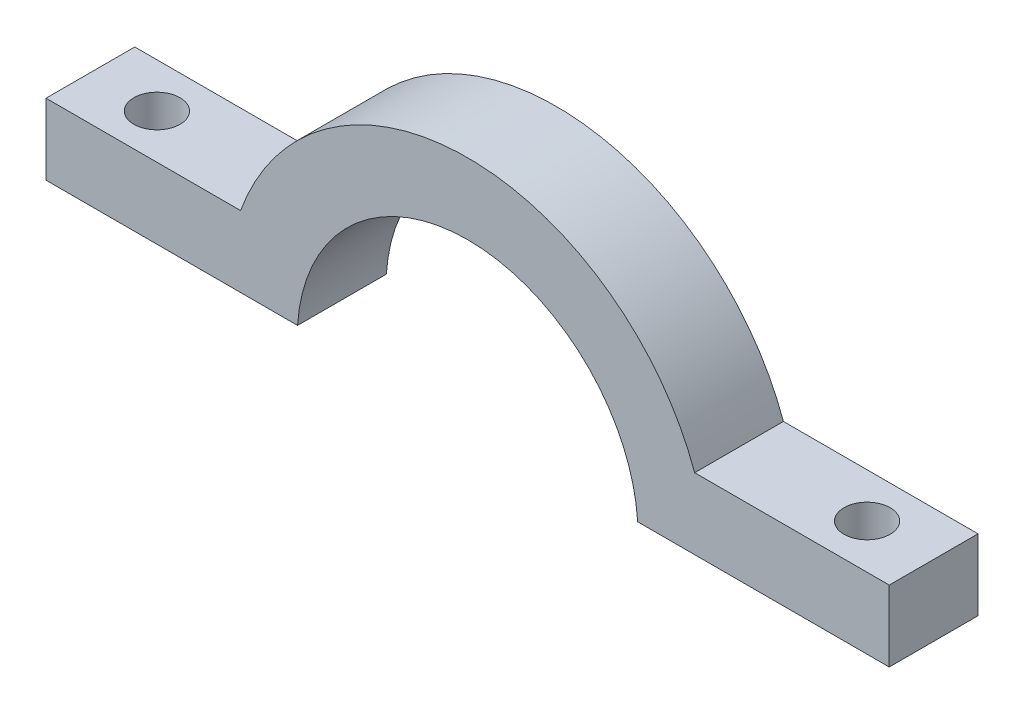
ISO-10303-21;
HEADER;
FILE_DESCRIPTION(('STEP AP214'),'2;1');
FILE_NAME('part.step','',(''),(''),'','','');
FILE_SCHEMA(('AUTOMOTIVE_DESIGN { 1 0 10303 214 1 1 1 1 }'));
ENDSEC;
DATA;
#1=APPLICATION_CONTEXT('core data for automotive mechanical design processes');
#2=APPLICATION_PROTOCOL_DEFINITION('international standard','automotive_design',2000,#1);
#3=PRODUCT_CONTEXT('',#1,'mechanical');
#4=PRODUCT('Part','Part','',(#3));
#5=PRODUCT_RELATED_PRODUCT_CATEGORY('part','',(#4));
#6=PRODUCT_DEFINITION_FORMATION('','',#4);
#7=PRODUCT_DEFINITION_CONTEXT('part definition',#1,'design');
#8=PRODUCT_DEFINITION('design','',#6,#7);
#9=PRODUCT_DEFINITION_SHAPE('','',#8);
#10=(LENGTH_UNIT() NAMED_UNIT(*) SI_UNIT(.MILLI.,.METRE.));
#11=(NAMED_UNIT(*) PLANE_ANGLE_UNIT() SI_UNIT($,.RADIAN.));
#12=(NAMED_UNIT(*) SI_UNIT($,.STERADIAN.) SOLID_ANGLE_UNIT());
#13=UNCERTAINTY_MEASURE_WITH_UNIT(LENGTH_MEASURE(1.E-05),#10,'distance_accuracy_value','');
#14=(GEOMETRIC_REPRESENTATION_CONTEXT(3) GLOBAL_UNCERTAINTY_ASSIGNED_CONTEXT((#13)) GLOBAL_UNIT_ASSIGNED_CONTEXT((#10,
#11,#12)) REPRESENTATION_CONTEXT('',''));
#15=CARTESIAN_POINT('',(0.,0.,0.));
#16=DIRECTION('',(0.,0.,1.));
#17=DIRECTION('',(1.,0.,0.));
#18=AXIS2_PLACEMENT_3D('',#15,#16,#17);
#19=CARTESIAN_POINT('',(0.,0.,6.35));
#20=DIRECTION('',(0.,0.,-1.));
#21=DIRECTION('',(-1.,0.,0.));
#22=AXIS2_PLACEMENT_3D('',#19,#20,#21);
#23=CYLINDRICAL_SURFACE('',#22,17.272);
#24=CARTESIAN_POINT('',(0.,0.,0.));
#25=DIRECTION('',(0.,0.,1.));
#26=DIRECTION('',(1.,0.,0.));
#27=AXIS2_PLACEMENT_3D('',#24,#25,#26);
#28=CIRCLE('',#27,17.272);
#29=CARTESIAN_POINT('',(16.2425689143528,5.87375000000007,0.));
#30=VERTEX_POINT('',#29);
#31=CARTESIAN_POINT('',(-16.2425689143528,5.87374999999999,0.));
#32=VERTEX_POINT('',#31);
#33=EDGE_CURVE('E141',#30,#32,#28,.T.);
#34=ORIENTED_EDGE('',*,*,#33,.T.);
#35=DIRECTION('',(0.,0.,-1.));
#36=VECTOR('',#35,1.);
#37=CARTESIAN_POINT('',(-16.2425689143528,5.87374999999999,6.35));
#38=LINE('',#37,#36);
#39=CARTESIAN_POINT('',(-16.2425689143528,5.87374999999999,6.35));
#40=VERTEX_POINT('',#39);
#41=EDGE_CURVE('E11',#40,#32,#38,.T.);
#42=ORIENTED_EDGE('',*,*,#41,.F.);
#43=CARTESIAN_POINT('',(0.,0.,6.35));
#44=DIRECTION('',(0.,0.,1.));
#45=DIRECTION('',(1.,0.,0.));
#46=AXIS2_PLACEMENT_3D('',#43,#44,#45);
#47=CIRCLE('',#46,17.272);
#48=CARTESIAN_POINT('',(16.2425689143528,5.87375000000007,6.35));
#49=VERTEX_POINT('',#48);
#50=EDGE_CURVE('E163',#49,#40,#47,.T.);
#51=ORIENTED_EDGE('',*,*,#50,.F.);
#52=DIRECTION('',(0.,0.,-1.));
#53=VECTOR('',#52,1.);
#54=CARTESIAN_POINT('',(16.2425689143528,5.87375000000007,6.35));
#55=LINE('',#54,#53);
#56=EDGE_CURVE('E137',#49,#30,#55,.T.);
#57=ORIENTED_EDGE('',*,*,#56,.T.);
#58=EDGE_LOOP('',(#34,#42,#51,#57));
#59=FACE_BOUND('',#58,.T.);
#60=ADVANCED_FACE('F39',(#59),#23,.T.);
#61=CARTESIAN_POINT('',(-16.2425689143528,5.87374999999999,6.35));
#62=DIRECTION('',(0.,-1.,0.));
#63=DIRECTION('',(1.,0.,0.));
#64=AXIS2_PLACEMENT_3D('',#61,#62,#63);
#65=PLANE('',#64);
#66=CARTESIAN_POINT('',(-25.4,5.87374999999999,3.175));
#67=DIRECTION('',(0.,1.,0.));
#68=DIRECTION('',(-1.,0.,0.));
#69=AXIS2_PLACEMENT_3D('',#66,#67,#68);
#70=CIRCLE('',#69,1.651);
#71=CARTESIAN_POINT('',(-27.051,5.87374999999999,3.175));
#72=VERTEX_POINT('',#71);
#73=EDGE_CURVE('E212',#72,#72,#70,.T.);
#74=ORIENTED_EDGE('',*,*,#73,.F.);
#75=EDGE_LOOP('',(#74));
#76=FACE_BOUND('',#75,.T.);
#77=DIRECTION('',(-1.,0.,0.));
#78=VECTOR('',#77,1.);
#79=CARTESIAN_POINT('',(-16.2425689143528,5.87374999999999,0.));
#80=LINE('',#79,#78);
#81=CARTESIAN_POINT('',(-30.1625,5.87374999999999,0.));
#82=VERTEX_POINT('',#81);
#83=EDGE_CURVE('E145',#32,#82,#80,.T.);
#84=ORIENTED_EDGE('',*,*,#83,.T.);
#85=DIRECTION('',(0.,0.,-1.));
#86=VECTOR('',#85,1.);
#87=CARTESIAN_POINT('',(-30.1625,5.87374999999999,6.35));
#88=LINE('',#87,#86);
#89=CARTESIAN_POINT('',(-30.1625,5.87374999999999,6.35));
#90=VERTEX_POINT('',#89);
#91=EDGE_CURVE('E49',#90,#82,#88,.T.);
#92=ORIENTED_EDGE('',*,*,#91,.F.);
#93=DIRECTION('',(-1.,0.,0.));
#94=VECTOR('',#93,1.);
#95=CARTESIAN_POINT('',(-16.2425689143528,5.87374999999999,6.35));
#96=LINE('',#95,#94);
#97=EDGE_CURVE('E100',#40,#90,#96,.T.);
#98=ORIENTED_EDGE('',*,*,#97,.F.);
#99=ORIENTED_EDGE('',*,*,#41,.T.);
#100=EDGE_LOOP('',(#84,#92,#98,#99));
#101=FACE_BOUND('',#100,.T.);
#102=ADVANCED_FACE('F224',(#76,#101),#65,.F.);
#103=CARTESIAN_POINT('',(-30.1625,5.87374999999999,6.35));
#104=DIRECTION('',(1.,0.,0.));
#105=DIRECTION('',(0.,0.,-1.));
#106=AXIS2_PLACEMENT_3D('',#103,#104,#105);
#107=PLANE('',#106);
#108=DIRECTION('',(0.,-1.,0.));
#109=VECTOR('',#108,1.);
#110=CARTESIAN_POINT('',(-30.1625,5.87374999999999,0.));
#111=LINE('',#110,#109);
#112=CARTESIAN_POINT('',(-30.1625,0.793749999999996,0.));
#113=VERTEX_POINT('',#112);
#114=EDGE_CURVE('E148',#82,#113,#111,.T.);
#115=ORIENTED_EDGE('',*,*,#114,.T.);
#116=DIRECTION('',(0.,0.,-1.));
#117=VECTOR('',#116,1.);
#118=CARTESIAN_POINT('',(-30.1625,0.793749999999996,6.35));
#119=LINE('',#118,#117);
#120=CARTESIAN_POINT('',(-30.1625,0.793749999999996,6.35));
#121=VERTEX_POINT('',#120);
#122=EDGE_CURVE('E174',#121,#113,#119,.T.);
#123=ORIENTED_EDGE('',*,*,#122,.F.);
#124=DIRECTION('',(0.,-1.,0.));
#125=VECTOR('',#124,1.);
#126=CARTESIAN_POINT('',(-30.1625,5.87374999999999,6.35));
#127=LINE('',#126,#125);
#128=EDGE_CURVE('E185',#90,#121,#127,.T.);
#129=ORIENTED_EDGE('',*,*,#128,.F.);
#130=ORIENTED_EDGE('',*,*,#91,.T.);
#131=EDGE_LOOP('',(#115,#123,#129,#130));
#132=FACE_BOUND('',#131,.T.);
#133=ADVANCED_FACE('F183',(#132),#107,.F.);
#134=CARTESIAN_POINT('',(-30.1625,0.793749999999996,6.35));
#135=DIRECTION('',(0.,1.,0.));
#136=DIRECTION('',(-1.,0.,0.));
#137=AXIS2_PLACEMENT_3D('',#134,#135,#136);
#138=PLANE('',#137);
#139=CARTESIAN_POINT('',(-25.4,0.793749999999995,3.175));
#140=DIRECTION('',(0.,1.,0.));
#141=DIRECTION('',(-1.,0.,0.));
#142=AXIS2_PLACEMENT_3D('',#139,#140,#141);
#143=CIRCLE('',#142,1.651);
#144=CARTESIAN_POINT('',(-27.051,0.793749999999995,3.175));
#145=VERTEX_POINT('',#144);
#146=EDGE_CURVE('E42',#145,#145,#143,.T.);
#147=ORIENTED_EDGE('',*,*,#146,.T.);
#148=EDGE_LOOP('',(#147));
#149=FACE_BOUND('',#148,.T.);
#150=DIRECTION('',(1.,0.,0.));
#151=VECTOR('',#150,1.);
#152=CARTESIAN_POINT('',(-30.1625,0.793749999999996,0.));
#153=LINE('',#152,#151);
#154=CARTESIAN_POINT('',(-12.1661343465169,0.793749999999994,0.));
#155=VERTEX_POINT('',#154);
#156=EDGE_CURVE('E151',#113,#155,#153,.T.);
#157=ORIENTED_EDGE('',*,*,#156,.T.);
#158=DIRECTION('',(0.,0.,-1.));
#159=VECTOR('',#158,1.);
#160=CARTESIAN_POINT('',(-12.1661343465169,0.793749999999994,6.35));
#161=LINE('',#160,#159);
#162=CARTESIAN_POINT('',(-12.1661343465169,0.793749999999994,6.35));
#163=VERTEX_POINT('',#162);
#164=EDGE_CURVE('E170',#163,#155,#161,.T.);
#165=ORIENTED_EDGE('',*,*,#164,.F.);
#166=DIRECTION('',(1.,0.,0.));
#167=VECTOR('',#166,1.);
#168=CARTESIAN_POINT('',(-30.1625,0.793749999999996,6.35));
#169=LINE('',#168,#167);
#170=EDGE_CURVE('E198',#121,#163,#169,.T.);
#171=ORIENTED_EDGE('',*,*,#170,.F.);
#172=ORIENTED_EDGE('',*,*,#122,.T.);
#173=EDGE_LOOP('',(#157,#165,#171,#172));
#174=FACE_BOUND('',#173,.T.);
#175=ADVANCED_FACE('F193',(#149,#174),#138,.F.);
#176=CARTESIAN_POINT('',(0.,0.,6.35));
#177=DIRECTION('',(0.,0.,-1.));
#178=DIRECTION('',(-1.,0.,0.));
#179=AXIS2_PLACEMENT_3D('',#176,#177,#178);
#180=CYLINDRICAL_SURFACE('',#179,12.192);
#181=CARTESIAN_POINT('',(0.,0.,0.));
#182=DIRECTION('',(0.,0.,-1.));
#183=DIRECTION('',(1.,0.,0.));
#184=AXIS2_PLACEMENT_3D('',#181,#182,#183);
#185=CIRCLE('',#184,12.192);
#186=CARTESIAN_POINT('',(12.1661343465169,0.79375000000004,0.));
#187=VERTEX_POINT('',#186);
#188=EDGE_CURVE('E154',#155,#187,#185,.T.);
#189=ORIENTED_EDGE('',*,*,#188,.T.);
#190=DIRECTION('',(0.,0.,-1.));
#191=VECTOR('',#190,1.);
#192=CARTESIAN_POINT('',(12.1661343465169,0.79375000000004,6.35));
#193=LINE('',#192,#191);
#194=CARTESIAN_POINT('',(12.1661343465169,0.79375000000004,6.35));
#195=VERTEX_POINT('',#194);
#196=EDGE_CURVE('E130',#195,#187,#193,.T.);
#197=ORIENTED_EDGE('',*,*,#196,.F.);
#198=CARTESIAN_POINT('',(0.,0.,6.35));
#199=DIRECTION('',(0.,0.,-1.));
#200=DIRECTION('',(1.,0.,0.));
#201=AXIS2_PLACEMENT_3D('',#198,#199,#200);
#202=CIRCLE('',#201,12.192);
#203=EDGE_CURVE('E119',#163,#195,#202,.T.);
#204=ORIENTED_EDGE('',*,*,#203,.F.);
#205=ORIENTED_EDGE('',*,*,#164,.T.);
#206=EDGE_LOOP('',(#189,#197,#204,#205));
#207=FACE_BOUND('',#206,.T.);
#208=ADVANCED_FACE('F196',(#207),#180,.F.);
#209=CARTESIAN_POINT('',(30.1624999999999,0.7937500000001,6.35));
#210=DIRECTION('',(0.,1.,0.));
#211=DIRECTION('',(-1.,0.,0.));
#212=AXIS2_PLACEMENT_3D('',#209,#210,#211);
#213=PLANE('',#212);
#214=CARTESIAN_POINT('',(25.4,0.793750000000084,3.175));
#215=DIRECTION('',(0.,1.,0.));
#216=DIRECTION('',(-1.,0.,0.));
#217=AXIS2_PLACEMENT_3D('',#214,#215,#216);
#218=CIRCLE('',#217,1.651);
#219=CARTESIAN_POINT('',(23.749,0.793750000000079,3.175));
#220=VERTEX_POINT('',#219);
#221=EDGE_CURVE('E208',#220,#220,#218,.T.);
#222=ORIENTED_EDGE('',*,*,#221,.T.);
#223=EDGE_LOOP('',(#222));
#224=FACE_BOUND('',#223,.T.);
#225=DIRECTION('',(1.,0.,0.));
#226=VECTOR('',#225,1.);
#227=CARTESIAN_POINT('',(30.1624999999999,0.7937500000001,0.));
#228=LINE('',#227,#226);
#229=CARTESIAN_POINT('',(30.1624999999999,0.7937500000001,0.));
#230=VERTEX_POINT('',#229);
#231=EDGE_CURVE('E128',#187,#230,#228,.T.);
#232=ORIENTED_EDGE('',*,*,#231,.T.);
#233=DIRECTION('',(0.,0.,-1.));
#234=VECTOR('',#233,1.);
#235=CARTESIAN_POINT('',(30.1624999999999,0.7937500000001,6.35));
#236=LINE('',#235,#234);
#237=CARTESIAN_POINT('',(30.1624999999999,0.7937500000001,6.35));
#238=VERTEX_POINT('',#237);
#239=EDGE_CURVE('E125',#238,#230,#236,.T.);
#240=ORIENTED_EDGE('',*,*,#239,.F.);
#241=DIRECTION('',(1.,0.,0.));
#242=VECTOR('',#241,1.);
#243=CARTESIAN_POINT('',(30.1624999999999,0.7937500000001,6.35));
#244=LINE('',#243,#242);
#245=EDGE_CURVE('E113',#195,#238,#244,.T.);
#246=ORIENTED_EDGE('',*,*,#245,.F.);
#247=ORIENTED_EDGE('',*,*,#196,.T.);
#248=EDGE_LOOP('',(#232,#240,#246,#247));
#249=FACE_BOUND('',#248,.T.);
#250=ADVANCED_FACE('F126',(#224,#249),#213,.F.);
#251=CARTESIAN_POINT('',(30.1624999999999,5.8737500000001,6.35));
#252=DIRECTION('',(-1.,0.,0.));
#253=DIRECTION('',(0.,-1.,0.));
#254=AXIS2_PLACEMENT_3D('',#251,#252,#253);
#255=PLANE('',#254);
#256=DIRECTION('',(0.,1.,0.));
#257=VECTOR('',#256,1.);
#258=CARTESIAN_POINT('',(30.1624999999999,5.8737500000001,0.));
#259=LINE('',#258,#257);
#260=CARTESIAN_POINT('',(30.1624999999999,5.8737500000001,0.));
#261=VERTEX_POINT('',#260);
#262=EDGE_CURVE('E86',#230,#261,#259,.T.);
#263=ORIENTED_EDGE('',*,*,#262,.T.);
#264=DIRECTION('',(0.,0.,-1.));
#265=VECTOR('',#264,1.);
#266=CARTESIAN_POINT('',(30.1624999999999,5.8737500000001,6.35));
#267=LINE('',#266,#265);
#268=CARTESIAN_POINT('',(30.1624999999999,5.8737500000001,6.35));
#269=VERTEX_POINT('',#268);
#270=EDGE_CURVE('E131',#269,#261,#267,.T.);
#271=ORIENTED_EDGE('',*,*,#270,.F.);
#272=DIRECTION('',(0.,1.,0.));
#273=VECTOR('',#272,1.);
#274=CARTESIAN_POINT('',(30.1624999999999,5.8737500000001,6.35));
#275=LINE('',#274,#273);
#276=EDGE_CURVE('E117',#238,#269,#275,.T.);
#277=ORIENTED_EDGE('',*,*,#276,.F.);
#278=ORIENTED_EDGE('',*,*,#239,.T.);
#279=EDGE_LOOP('',(#263,#271,#277,#278));
#280=FACE_BOUND('',#279,.T.);
#281=ADVANCED_FACE('F133',(#280),#255,.F.);
#282=CARTESIAN_POINT('',(16.2425689143528,5.87375000000007,6.35));
#283=DIRECTION('',(0.,-1.,0.));
#284=DIRECTION('',(1.,0.,0.));
#285=AXIS2_PLACEMENT_3D('',#282,#283,#284);
#286=PLANE('',#285);
#287=CARTESIAN_POINT('',(25.4,5.87374999999998,3.175));
#288=DIRECTION('',(0.,1.,0.));
#289=DIRECTION('',(-1.,0.,0.));
#290=AXIS2_PLACEMENT_3D('',#287,#288,#289);
#291=CIRCLE('',#290,1.651);
#292=CARTESIAN_POINT('',(23.749,5.87374999999998,3.175));
#293=VERTEX_POINT('',#292);
#294=EDGE_CURVE('E213',#293,#293,#291,.T.);
#295=ORIENTED_EDGE('',*,*,#294,.F.);
#296=EDGE_LOOP('',(#295));
#297=FACE_BOUND('',#296,.T.);
#298=DIRECTION('',(-1.,0.,0.));
#299=VECTOR('',#298,1.);
#300=CARTESIAN_POINT('',(16.2425689143528,5.87375000000007,0.));
#301=LINE('',#300,#299);
#302=EDGE_CURVE('E92',#261,#30,#301,.T.);
#303=ORIENTED_EDGE('',*,*,#302,.T.);
#304=ORIENTED_EDGE('',*,*,#56,.F.);
#305=DIRECTION('',(-1.,0.,0.));
#306=VECTOR('',#305,1.);
#307=CARTESIAN_POINT('',(16.2425689143528,5.87375000000007,6.35));
#308=LINE('',#307,#306);
#309=EDGE_CURVE('E57',#269,#49,#308,.T.);
#310=ORIENTED_EDGE('',*,*,#309,.F.);
#311=ORIENTED_EDGE('',*,*,#270,.T.);
#312=EDGE_LOOP('',(#303,#304,#310,#311));
#313=FACE_BOUND('',#312,.T.);
#314=ADVANCED_FACE('F229',(#297,#313),#286,.F.);
#315=CARTESIAN_POINT('',(0.,0.,6.35));
#316=DIRECTION('',(0.,0.,1.));
#317=DIRECTION('',(1.,0.,0.));
#318=AXIS2_PLACEMENT_3D('',#315,#316,#317);
#319=PLANE('',#318);
#320=ORIENTED_EDGE('',*,*,#50,.T.);
#321=ORIENTED_EDGE('',*,*,#97,.T.);
#322=ORIENTED_EDGE('',*,*,#128,.T.);
#323=ORIENTED_EDGE('',*,*,#170,.T.);
#324=ORIENTED_EDGE('',*,*,#203,.T.);
#325=ORIENTED_EDGE('',*,*,#245,.T.);
#326=ORIENTED_EDGE('',*,*,#276,.T.);
#327=ORIENTED_EDGE('',*,*,#309,.T.);
#328=EDGE_LOOP('',(#320,#321,#322,#323,#324,#325,#326,#327));
#329=FACE_BOUND('',#328,.T.);
#330=ADVANCED_FACE('F115',(#329),#319,.T.);
#331=CARTESIAN_POINT('',(0.,0.,0.));
#332=DIRECTION('',(0.,0.,1.));
#333=DIRECTION('',(1.,0.,0.));
#334=AXIS2_PLACEMENT_3D('',#331,#332,#333);
#335=PLANE('',#334);
#336=ORIENTED_EDGE('',*,*,#33,.F.);
#337=ORIENTED_EDGE('',*,*,#302,.F.);
#338=ORIENTED_EDGE('',*,*,#262,.F.);
#339=ORIENTED_EDGE('',*,*,#231,.F.);
#340=ORIENTED_EDGE('',*,*,#188,.F.);
#341=ORIENTED_EDGE('',*,*,#156,.F.);
#342=ORIENTED_EDGE('',*,*,#114,.F.);
#343=ORIENTED_EDGE('',*,*,#83,.F.);
#344=EDGE_LOOP('',(#336,#337,#338,#339,#340,#341,#342,#343));
#345=FACE_BOUND('',#344,.T.);
#346=ADVANCED_FACE('F189',(#345),#335,.F.);
#347=CARTESIAN_POINT('',(25.4,-0.476250000000016,3.175));
#348=DIRECTION('',(0.,1.,0.));
#349=DIRECTION('',(-1.,0.,0.));
#350=AXIS2_PLACEMENT_3D('',#347,#348,#349);
#351=CYLINDRICAL_SURFACE('',#350,1.651);
#352=ORIENTED_EDGE('',*,*,#294,.T.);
#353=EDGE_LOOP('',(#352));
#354=FACE_BOUND('',#353,.T.);
#355=ORIENTED_EDGE('',*,*,#221,.F.);
#356=EDGE_LOOP('',(#355));
#357=FACE_BOUND('',#356,.T.);
#358=ADVANCED_FACE('F293',(#354,#357),#351,.F.);
#359=CARTESIAN_POINT('',(-25.4,-0.476250000000007,3.175));
#360=DIRECTION('',(0.,1.,0.));
#361=DIRECTION('',(-1.,0.,0.));
#362=AXIS2_PLACEMENT_3D('',#359,#360,#361);
#363=CYLINDRICAL_SURFACE('',#362,1.651);
#364=ORIENTED_EDGE('',*,*,#73,.T.);
#365=EDGE_LOOP('',(#364));
#366=FACE_BOUND('',#365,.T.);
#367=ORIENTED_EDGE('',*,*,#146,.F.);
#368=EDGE_LOOP('',(#367));
#369=FACE_BOUND('',#368,.T.);
#370=ADVANCED_FACE('F221',(#366,#369),#363,.F.);
#371=CLOSED_SHELL('',(#60,#102,#133,#175,#208,#250,#281,#314,#330,#346,#358,#370));
#372=MANIFOLD_SOLID_BREP('B2',#371);
#373=ADVANCED_BREP_SHAPE_REPRESENTATION('',(#18,#372),#14);
#374=SHAPE_DEFINITION_REPRESENTATION(#9,#373);
ENDSEC;
END-ISO-10303-21;
